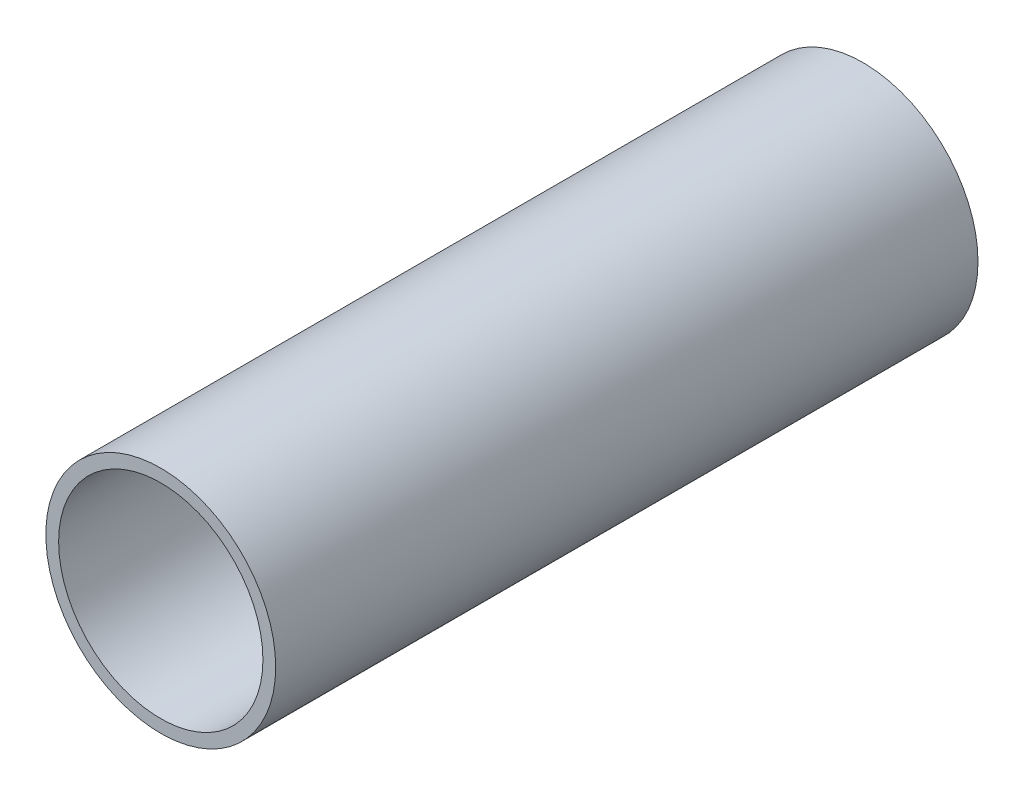
ISO-10303-21;
HEADER;
FILE_DESCRIPTION(('STEP AP214'),'2;1');
FILE_NAME('part.step','',(''),(''),'','','');
FILE_SCHEMA(('AUTOMOTIVE_DESIGN { 1 0 10303 214 1 1 1 1 }'));
ENDSEC;
DATA;
#1=APPLICATION_CONTEXT('core data for automotive mechanical design processes');
#2=APPLICATION_PROTOCOL_DEFINITION('international standard','automotive_design',2000,#1);
#3=PRODUCT_CONTEXT('',#1,'mechanical');
#4=PRODUCT('Part','Part','',(#3));
#5=PRODUCT_RELATED_PRODUCT_CATEGORY('part','',(#4));
#6=PRODUCT_DEFINITION_FORMATION('','',#4);
#7=PRODUCT_DEFINITION_CONTEXT('part definition',#1,'design');
#8=PRODUCT_DEFINITION('design','',#6,#7);
#9=PRODUCT_DEFINITION_SHAPE('','',#8);
#10=(LENGTH_UNIT() NAMED_UNIT(*) SI_UNIT(.MILLI.,.METRE.));
#11=(NAMED_UNIT(*) PLANE_ANGLE_UNIT() SI_UNIT($,.RADIAN.));
#12=(NAMED_UNIT(*) SI_UNIT($,.STERADIAN.) SOLID_ANGLE_UNIT());
#13=UNCERTAINTY_MEASURE_WITH_UNIT(LENGTH_MEASURE(1.E-05),#10,'distance_accuracy_value','');
#14=(GEOMETRIC_REPRESENTATION_CONTEXT(3) GLOBAL_UNCERTAINTY_ASSIGNED_CONTEXT((#13)) GLOBAL_UNIT_ASSIGNED_CONTEXT((#10,
#11,#12)) REPRESENTATION_CONTEXT('',''));
#15=CARTESIAN_POINT('',(0.,0.,0.));
#16=DIRECTION('',(0.,0.,1.));
#17=DIRECTION('',(1.,0.,0.));
#18=AXIS2_PLACEMENT_3D('',#15,#16,#17);
#19=CARTESIAN_POINT('',(0.,0.,110.));
#20=DIRECTION('',(0.,0.,1.));
#21=DIRECTION('',(1.,0.,0.));
#22=AXIS2_PLACEMENT_3D('',#19,#20,#21);
#23=PLANE('',#22);
#24=CARTESIAN_POINT('',(0.,0.,110.));
#25=DIRECTION('',(0.,0.,1.));
#26=DIRECTION('',(1.,0.,0.));
#27=AXIS2_PLACEMENT_3D('',#24,#25,#26);
#28=CIRCLE('',#27,18.);
#29=CARTESIAN_POINT('',(18.,0.,110.));
#30=VERTEX_POINT('',#29);
#31=EDGE_CURVE('E10',#30,#30,#28,.T.);
#32=ORIENTED_EDGE('',*,*,#31,.T.);
#33=EDGE_LOOP('',(#32));
#34=FACE_BOUND('',#33,.T.);
#35=CARTESIAN_POINT('',(0.,0.,110.));
#36=DIRECTION('',(0.,0.,1.));
#37=DIRECTION('',(1.,0.,0.));
#38=AXIS2_PLACEMENT_3D('',#35,#36,#37);
#39=CIRCLE('',#38,16.);
#40=CARTESIAN_POINT('',(16.,0.,110.));
#41=VERTEX_POINT('',#40);
#42=EDGE_CURVE('E43',#41,#41,#39,.T.);
#43=ORIENTED_EDGE('',*,*,#42,.F.);
#44=EDGE_LOOP('',(#43));
#45=FACE_BOUND('',#44,.T.);
#46=ADVANCED_FACE('F32',(#34,#45),#23,.T.);
#47=CARTESIAN_POINT('',(0.,0.,0.));
#48=DIRECTION('',(0.,0.,1.));
#49=DIRECTION('',(1.,0.,0.));
#50=AXIS2_PLACEMENT_3D('',#47,#48,#49);
#51=PLANE('',#50);
#52=CARTESIAN_POINT('',(0.,0.,0.));
#53=DIRECTION('',(0.,0.,1.));
#54=DIRECTION('',(1.,0.,0.));
#55=AXIS2_PLACEMENT_3D('',#52,#53,#54);
#56=CIRCLE('',#55,18.);
#57=CARTESIAN_POINT('',(18.,0.,0.));
#58=VERTEX_POINT('',#57);
#59=EDGE_CURVE('E36',#58,#58,#56,.T.);
#60=ORIENTED_EDGE('',*,*,#59,.F.);
#61=EDGE_LOOP('',(#60));
#62=FACE_BOUND('',#61,.T.);
#63=CARTESIAN_POINT('',(0.,0.,0.));
#64=DIRECTION('',(0.,0.,1.));
#65=DIRECTION('',(1.,0.,0.));
#66=AXIS2_PLACEMENT_3D('',#63,#64,#65);
#67=CIRCLE('',#66,16.);
#68=CARTESIAN_POINT('',(16.,0.,0.));
#69=VERTEX_POINT('',#68);
#70=EDGE_CURVE('E45',#69,#69,#67,.T.);
#71=ORIENTED_EDGE('',*,*,#70,.T.);
#72=EDGE_LOOP('',(#71));
#73=FACE_BOUND('',#72,.T.);
#74=ADVANCED_FACE('F55',(#62,#73),#51,.F.);
#75=CARTESIAN_POINT('',(0.,0.,110.));
#76=DIRECTION('',(0.,0.,-1.));
#77=DIRECTION('',(-1.,0.,0.));
#78=AXIS2_PLACEMENT_3D('',#75,#76,#77);
#79=CYLINDRICAL_SURFACE('',#78,18.);
#80=ORIENTED_EDGE('',*,*,#31,.F.);
#81=EDGE_LOOP('',(#80));
#82=FACE_BOUND('',#81,.T.);
#83=ORIENTED_EDGE('',*,*,#59,.T.);
#84=EDGE_LOOP('',(#83));
#85=FACE_BOUND('',#84,.T.);
#86=ADVANCED_FACE('F34',(#82,#85),#79,.T.);
#87=CARTESIAN_POINT('',(0.,0.,110.));
#88=DIRECTION('',(0.,0.,-1.));
#89=DIRECTION('',(-1.,0.,0.));
#90=AXIS2_PLACEMENT_3D('',#87,#88,#89);
#91=CYLINDRICAL_SURFACE('',#90,16.);
#92=ORIENTED_EDGE('',*,*,#42,.T.);
#93=EDGE_LOOP('',(#92));
#94=FACE_BOUND('',#93,.T.);
#95=ORIENTED_EDGE('',*,*,#70,.F.);
#96=EDGE_LOOP('',(#95));
#97=FACE_BOUND('',#96,.T.);
#98=ADVANCED_FACE('F51',(#94,#97),#91,.F.);
#99=CLOSED_SHELL('',(#46,#74,#86,#98));
#100=MANIFOLD_SOLID_BREP('B2',#99);
#101=ADVANCED_BREP_SHAPE_REPRESENTATION('',(#18,#100),#14);
#102=SHAPE_DEFINITION_REPRESENTATION(#9,#101);
ENDSEC;
END-ISO-10303-21;
